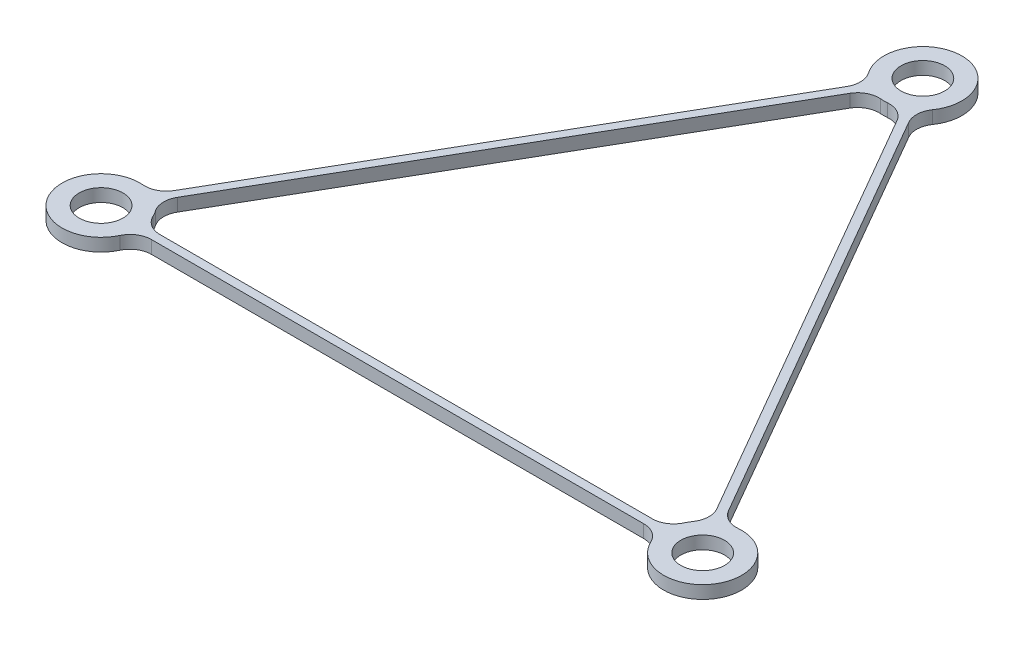
ISO-10303-21;
HEADER;
FILE_DESCRIPTION(('STEP AP214'),'2;1');
FILE_NAME('part.step','',(''),(''),'','','');
FILE_SCHEMA(('AUTOMOTIVE_DESIGN { 1 0 10303 214 1 1 1 1 }'));
ENDSEC;
DATA;
#1=APPLICATION_CONTEXT('core data for automotive mechanical design processes');
#2=APPLICATION_PROTOCOL_DEFINITION('international standard','automotive_design',2000,#1);
#3=PRODUCT_CONTEXT('',#1,'mechanical');
#4=PRODUCT('Part','Part','',(#3));
#5=PRODUCT_RELATED_PRODUCT_CATEGORY('part','',(#4));
#6=PRODUCT_DEFINITION_FORMATION('','',#4);
#7=PRODUCT_DEFINITION_CONTEXT('part definition',#1,'design');
#8=PRODUCT_DEFINITION('design','',#6,#7);
#9=PRODUCT_DEFINITION_SHAPE('','',#8);
#10=(LENGTH_UNIT() NAMED_UNIT(*) SI_UNIT(.MILLI.,.METRE.));
#11=(NAMED_UNIT(*) PLANE_ANGLE_UNIT() SI_UNIT($,.RADIAN.));
#12=(NAMED_UNIT(*) SI_UNIT($,.STERADIAN.) SOLID_ANGLE_UNIT());
#13=UNCERTAINTY_MEASURE_WITH_UNIT(LENGTH_MEASURE(1.E-05),#10,'distance_accuracy_value','');
#14=(GEOMETRIC_REPRESENTATION_CONTEXT(3) GLOBAL_UNCERTAINTY_ASSIGNED_CONTEXT((#13)) GLOBAL_UNIT_ASSIGNED_CONTEXT((#10,
#11,#12)) REPRESENTATION_CONTEXT('',''));
#15=CARTESIAN_POINT('',(0.,0.,0.));
#16=DIRECTION('',(0.,0.,1.));
#17=DIRECTION('',(1.,0.,0.));
#18=AXIS2_PLACEMENT_3D('',#15,#16,#17);
#19=CARTESIAN_POINT('',(-35.1,0.75,20.2649944485559));
#20=DIRECTION('',(0.,1.,0.));
#21=DIRECTION('',(0.,0.,1.));
#22=AXIS2_PLACEMENT_3D('',#19,#20,#21);
#23=PLANE('',#22);
#24=CARTESIAN_POINT('',(35.1,0.75,20.2649944485559));
#25=DIRECTION('',(0.,1.,0.));
#26=DIRECTION('',(0.,0.,1.));
#27=AXIS2_PLACEMENT_3D('',#24,#25,#26);
#28=CIRCLE('',#27,2.55);
#29=CARTESIAN_POINT('',(35.1,0.75,22.8149944485559));
#30=VERTEX_POINT('',#29);
#31=EDGE_CURVE('E378',#30,#30,#28,.T.);
#32=ORIENTED_EDGE('',*,*,#31,.F.);
#33=EDGE_LOOP('',(#32));
#34=FACE_BOUND('',#33,.T.);
#35=DIRECTION('',(-0.5,0.,0.866025403784439));
#36=VECTOR('',#35,1.);
#37=CARTESIAN_POINT('',(-33.27179068714,0.75,16.0984430318118));
#38=LINE('',#37,#36);
#39=CARTESIAN_POINT('',(-3.62293824961275,0.75,-35.2548757760978));
#40=VERTEX_POINT('',#39);
#41=CARTESIAN_POINT('',(-32.3430871541717,0.75,14.489881327542));
#42=VERTEX_POINT('',#41);
#43=EDGE_CURVE('E217',#40,#42,#38,.T.);
#44=ORIENTED_EDGE('',*,*,#43,.T.);
#45=CARTESIAN_POINT('',(-34.5081506636328,0.75,13.239881327542));
#46=DIRECTION('',(0.,1.,0.));
#47=DIRECTION('',(0.,0.,1.));
#48=AXIS2_PLACEMENT_3D('',#45,#46,#47);
#49=CIRCLE('',#48,2.5);
#50=CARTESIAN_POINT('',(-34.7180263148269,0.75,15.7310561931497));
#51=VERTEX_POINT('',#50);
#52=EDGE_CURVE('E276',#42,#51,#49,.F.);
#53=ORIENTED_EDGE('',*,*,#52,.T.);
#54=CARTESIAN_POINT('',(-35.1,0.75,20.2649944485559));
#55=DIRECTION('',(0.,1.,0.));
#56=DIRECTION('',(0.,0.,1.));
#57=AXIS2_PLACEMENT_3D('',#54,#55,#56);
#58=CIRCLE('',#57,4.55);
#59=CARTESIAN_POINT('',(-30.9825074490416,0.75,22.2011646613218));
#60=VERTEX_POINT('',#59);
#61=EDGE_CURVE('E225',#51,#60,#58,.T.);
#62=ORIENTED_EDGE('',*,*,#61,.T.);
#63=CARTESIAN_POINT('',(-28.720148904559,0.75,23.2649944485559));
#64=DIRECTION('',(0.,1.,0.));
#65=DIRECTION('',(0.,0.,1.));
#66=AXIS2_PLACEMENT_3D('',#63,#64,#65);
#67=CIRCLE('',#66,2.5);
#68=CARTESIAN_POINT('',(-28.720148904559,0.75,20.7649944485559));
#69=VERTEX_POINT('',#68);
#70=EDGE_CURVE('E273',#60,#69,#67,.F.);
#71=ORIENTED_EDGE('',*,*,#70,.T.);
#72=DIRECTION('',(1.,0.,0.));
#73=VECTOR('',#72,1.);
#74=CARTESIAN_POINT('',(30.5775559704956,0.75,20.7649944485559));
#75=LINE('',#74,#73);
#76=CARTESIAN_POINT('',(28.720148904559,0.75,20.7649944485559));
#77=VERTEX_POINT('',#76);
#78=EDGE_CURVE('E229',#69,#77,#75,.T.);
#79=ORIENTED_EDGE('',*,*,#78,.T.);
#80=CARTESIAN_POINT('',(28.720148904559,0.75,23.2649944485559));
#81=DIRECTION('',(0.,1.,0.));
#82=DIRECTION('',(0.,0.,1.));
#83=AXIS2_PLACEMENT_3D('',#80,#81,#82);
#84=CIRCLE('',#83,2.5);
#85=CARTESIAN_POINT('',(30.9825074490416,0.75,22.2011646613218));
#86=VERTEX_POINT('',#85);
#87=EDGE_CURVE('E269',#77,#86,#84,.F.);
#88=ORIENTED_EDGE('',*,*,#87,.T.);
#89=CARTESIAN_POINT('',(35.1,0.75,20.2649944485559));
#90=DIRECTION('',(0.,1.,0.));
#91=DIRECTION('',(0.,0.,1.));
#92=AXIS2_PLACEMENT_3D('',#89,#90,#91);
#93=CIRCLE('',#92,4.55);
#94=CARTESIAN_POINT('',(34.7180263148269,0.75,15.7310561931497));
#95=VERTEX_POINT('',#94);
#96=EDGE_CURVE('E392',#86,#95,#93,.T.);
#97=ORIENTED_EDGE('',*,*,#96,.T.);
#98=CARTESIAN_POINT('',(34.5081506636328,0.75,13.239881327542));
#99=DIRECTION('',(0.,1.,0.));
#100=DIRECTION('',(0.,0.,1.));
#101=AXIS2_PLACEMENT_3D('',#98,#99,#100);
#102=CIRCLE('',#101,2.5);
#103=CARTESIAN_POINT('',(32.3430871541717,0.75,14.489881327542));
#104=VERTEX_POINT('',#103);
#105=EDGE_CURVE('E265',#95,#104,#102,.F.);
#106=ORIENTED_EDGE('',*,*,#105,.T.);
#107=DIRECTION('',(-0.5,0.,-0.866025403784439));
#108=VECTOR('',#107,1.);
#109=CARTESIAN_POINT('',(33.27179068714,0.75,16.0984430318118));
#110=LINE('',#109,#108);
#111=CARTESIAN_POINT('',(3.62293824961274,0.75,-35.2548757760978));
#112=VERTEX_POINT('',#111);
#113=EDGE_CURVE('E395',#104,#112,#110,.T.);
#114=ORIENTED_EDGE('',*,*,#113,.T.);
#115=CARTESIAN_POINT('',(5.78800175907384,0.75,-36.5048757760978));
#116=DIRECTION('',(0.,1.,0.));
#117=DIRECTION('',(0.,0.,1.));
#118=AXIS2_PLACEMENT_3D('',#115,#116,#117);
#119=CIRCLE('',#118,2.5);
#120=CARTESIAN_POINT('',(3.73551886578525,0.75,-37.9322208544716));
#121=VERTEX_POINT('',#120);
#122=EDGE_CURVE('E261',#112,#121,#119,.F.);
#123=ORIENTED_EDGE('',*,*,#122,.T.);
#124=CARTESIAN_POINT('',(0.,0.75,-40.5299888971117));
#125=DIRECTION('',(0.,1.,0.));
#126=DIRECTION('',(0.,0.,1.));
#127=AXIS2_PLACEMENT_3D('',#124,#125,#126);
#128=CIRCLE('',#127,4.55);
#129=CARTESIAN_POINT('',(-3.73551886578525,0.75,-37.9322208544716));
#130=VERTEX_POINT('',#129);
#131=EDGE_CURVE('E398',#121,#130,#128,.T.);
#132=ORIENTED_EDGE('',*,*,#131,.T.);
#133=CARTESIAN_POINT('',(-5.78800175907385,0.75,-36.5048757760978));
#134=DIRECTION('',(0.,1.,0.));
#135=DIRECTION('',(0.,0.,1.));
#136=AXIS2_PLACEMENT_3D('',#133,#134,#135);
#137=CIRCLE('',#136,2.5);
#138=EDGE_CURVE('E207',#130,#40,#137,.F.);
#139=ORIENTED_EDGE('',*,*,#138,.T.);
#140=EDGE_LOOP('',(#44,#53,#62,#71,#79,#88,#97,#106,#114,#123,#132,#139));
#141=FACE_BOUND('',#140,.T.);
#142=CARTESIAN_POINT('',(0.,0.75,-40.5299888971117));
#143=DIRECTION('',(0.,1.,0.));
#144=DIRECTION('',(0.,0.,1.));
#145=AXIS2_PLACEMENT_3D('',#142,#143,#144);
#146=CIRCLE('',#145,2.55);
#147=CARTESIAN_POINT('',(0.,0.75,-37.9799888971117));
#148=VERTEX_POINT('',#147);
#149=EDGE_CURVE('E384',#148,#148,#146,.T.);
#150=ORIENTED_EDGE('',*,*,#149,.F.);
#151=EDGE_LOOP('',(#150));
#152=FACE_BOUND('',#151,.T.);
#153=CARTESIAN_POINT('',(-35.1,0.75,20.2649944485559));
#154=DIRECTION('',(0.,1.,0.));
#155=DIRECTION('',(0.,0.,1.));
#156=AXIS2_PLACEMENT_3D('',#153,#154,#155);
#157=CIRCLE('',#156,2.55);
#158=CARTESIAN_POINT('',(-35.1,0.75,22.8149944485559));
#159=VERTEX_POINT('',#158);
#160=EDGE_CURVE('E372',#159,#159,#157,.T.);
#161=ORIENTED_EDGE('',*,*,#160,.F.);
#162=EDGE_LOOP('',(#161));
#163=FACE_BOUND('',#162,.T.);
#164=DIRECTION('',(-0.5,0.,0.866025403784439));
#165=VECTOR('',#164,1.);
#166=CARTESIAN_POINT('',(-1.82820931286,0.75,-36.3634374803677));
#167=LINE('',#166,#165);
#168=CARTESIAN_POINT('',(-2.75691284582831,0.75,-34.7548757760978));
#169=VERTEX_POINT('',#168);
#170=CARTESIAN_POINT('',(-31.4770617503873,0.75,14.989881327542));
#171=VERTEX_POINT('',#170);
#172=EDGE_CURVE('E344',#169,#171,#167,.T.);
#173=ORIENTED_EDGE('',*,*,#172,.F.);
#174=CARTESIAN_POINT('',(-0.591849336367215,0.75,-33.5048757760978));
#175=DIRECTION('',(0.,1.,0.));
#176=DIRECTION('',(0.,0.,1.));
#177=AXIS2_PLACEMENT_3D('',#174,#175,#176);
#178=CIRCLE('',#177,2.5);
#179=CARTESIAN_POINT('',(-0.381973685173168,0.75,-35.9960506417056));
#180=VERTEX_POINT('',#179);
#181=EDGE_CURVE('E11',#169,#180,#178,.F.);
#182=ORIENTED_EDGE('',*,*,#181,.T.);
#183=CARTESIAN_POINT('',(0.,0.75,-40.5299888971117));
#184=DIRECTION('',(0.,-1.,0.));
#185=DIRECTION('',(0.,0.,1.));
#186=AXIS2_PLACEMENT_3D('',#183,#184,#185);
#187=CIRCLE('',#186,4.55);
#188=CARTESIAN_POINT('',(0.381973685173135,0.75,-35.9960506417056));
#189=VERTEX_POINT('',#188);
#190=EDGE_CURVE('E342',#189,#180,#187,.T.);
#191=ORIENTED_EDGE('',*,*,#190,.F.);
#192=CARTESIAN_POINT('',(0.591849336367165,0.75,-33.5048757760978));
#193=DIRECTION('',(0.,1.,0.));
#194=DIRECTION('',(0.,0.,1.));
#195=AXIS2_PLACEMENT_3D('',#192,#193,#194);
#196=CIRCLE('',#195,2.5);
#197=CARTESIAN_POINT('',(2.75691284582827,0.75,-34.7548757760978));
#198=VERTEX_POINT('',#197);
#199=EDGE_CURVE('E325',#189,#198,#196,.F.);
#200=ORIENTED_EDGE('',*,*,#199,.T.);
#201=DIRECTION('',(-0.5,0.,-0.866025403784438));
#202=VECTOR('',#201,1.);
#203=CARTESIAN_POINT('',(32.4057652833556,0.75,16.5984430318118));
#204=LINE('',#203,#202);
#205=CARTESIAN_POINT('',(31.4770617503873,0.75,14.989881327542));
#206=VERTEX_POINT('',#205);
#207=EDGE_CURVE('E360',#206,#198,#204,.T.);
#208=ORIENTED_EDGE('',*,*,#207,.F.);
#209=CARTESIAN_POINT('',(29.3119982409262,0.75,16.239881327542));
#210=DIRECTION('',(0.,1.,0.));
#211=DIRECTION('',(0.,0.,1.));
#212=AXIS2_PLACEMENT_3D('',#209,#210,#211);
#213=CIRCLE('',#212,2.5);
#214=CARTESIAN_POINT('',(31.3644811342148,0.75,17.6672264059157));
#215=VERTEX_POINT('',#214);
#216=EDGE_CURVE('E321',#206,#215,#213,.F.);
#217=ORIENTED_EDGE('',*,*,#216,.T.);
#218=CARTESIAN_POINT('',(35.1,0.75,20.2649944485559));
#219=DIRECTION('',(0.,-1.,0.));
#220=DIRECTION('',(0.,0.,1.));
#221=AXIS2_PLACEMENT_3D('',#218,#219,#220);
#222=CIRCLE('',#221,4.55);
#223=CARTESIAN_POINT('',(30.9825074490416,0.75,18.3288242357899));
#224=VERTEX_POINT('',#223);
#225=EDGE_CURVE('E357',#224,#215,#222,.T.);
#226=ORIENTED_EDGE('',*,*,#225,.F.);
#227=CARTESIAN_POINT('',(28.720148904559,0.75,17.2649944485559));
#228=DIRECTION('',(0.,1.,0.));
#229=DIRECTION('',(0.,0.,1.));
#230=AXIS2_PLACEMENT_3D('',#227,#228,#229);
#231=CIRCLE('',#230,2.5);
#232=CARTESIAN_POINT('',(28.720148904559,0.75,19.7649944485559));
#233=VERTEX_POINT('',#232);
#234=EDGE_CURVE('E317',#224,#233,#231,.F.);
#235=ORIENTED_EDGE('',*,*,#234,.T.);
#236=DIRECTION('',(1.,0.,0.));
#237=VECTOR('',#236,1.);
#238=CARTESIAN_POINT('',(-30.5775559704956,0.75,19.7649944485559));
#239=LINE('',#238,#237);
#240=CARTESIAN_POINT('',(-28.720148904559,0.75,19.7649944485559));
#241=VERTEX_POINT('',#240);
#242=EDGE_CURVE('E354',#241,#233,#239,.T.);
#243=ORIENTED_EDGE('',*,*,#242,.F.);
#244=CARTESIAN_POINT('',(-28.720148904559,0.75,17.2649944485559));
#245=DIRECTION('',(0.,1.,0.));
#246=DIRECTION('',(0.,0.,1.));
#247=AXIS2_PLACEMENT_3D('',#244,#245,#246);
#248=CIRCLE('',#247,2.5);
#249=CARTESIAN_POINT('',(-30.9825074490416,0.75,18.3288242357899));
#250=VERTEX_POINT('',#249);
#251=EDGE_CURVE('E313',#241,#250,#248,.F.);
#252=ORIENTED_EDGE('',*,*,#251,.T.);
#253=CARTESIAN_POINT('',(-35.1,0.75,20.2649944485559));
#254=DIRECTION('',(0.,-1.,0.));
#255=DIRECTION('',(0.,0.,1.));
#256=AXIS2_PLACEMENT_3D('',#253,#254,#255);
#257=CIRCLE('',#256,4.55);
#258=CARTESIAN_POINT('',(-31.3644811342148,0.75,17.6672264059157));
#259=VERTEX_POINT('',#258);
#260=EDGE_CURVE('E347',#259,#250,#257,.T.);
#261=ORIENTED_EDGE('',*,*,#260,.F.);
#262=CARTESIAN_POINT('',(-29.3119982409262,0.75,16.239881327542));
#263=DIRECTION('',(0.,1.,0.));
#264=DIRECTION('',(0.,0.,1.));
#265=AXIS2_PLACEMENT_3D('',#262,#263,#264);
#266=CIRCLE('',#265,2.5);
#267=EDGE_CURVE('E309',#259,#171,#266,.F.);
#268=ORIENTED_EDGE('',*,*,#267,.T.);
#269=EDGE_LOOP('',(#173,#182,#191,#200,#208,#217,#226,#235,#243,#252,#261,#268));
#270=FACE_BOUND('',#269,.T.);
#271=ADVANCED_FACE('F36',(#34,#141,#152,#163,#270),#23,.T.);
#272=CARTESIAN_POINT('',(-35.1,-0.75,20.2649944485559));
#273=DIRECTION('',(0.,1.,0.));
#274=DIRECTION('',(0.,0.,1.));
#275=AXIS2_PLACEMENT_3D('',#272,#273,#274);
#276=PLANE('',#275);
#277=CARTESIAN_POINT('',(-35.1,-0.75,20.2649944485559));
#278=DIRECTION('',(0.,1.,0.));
#279=DIRECTION('',(0.,0.,1.));
#280=AXIS2_PLACEMENT_3D('',#277,#278,#279);
#281=CIRCLE('',#280,2.55);
#282=CARTESIAN_POINT('',(-35.1,-0.75,22.8149944485559));
#283=VERTEX_POINT('',#282);
#284=EDGE_CURVE('E363',#283,#283,#281,.T.);
#285=ORIENTED_EDGE('',*,*,#284,.T.);
#286=EDGE_LOOP('',(#285));
#287=FACE_BOUND('',#286,.T.);
#288=CARTESIAN_POINT('',(35.1,-0.75,20.2649944485559));
#289=DIRECTION('',(0.,1.,0.));
#290=DIRECTION('',(0.,0.,1.));
#291=AXIS2_PLACEMENT_3D('',#288,#289,#290);
#292=CIRCLE('',#291,2.55);
#293=CARTESIAN_POINT('',(35.1,-0.75,22.8149944485559));
#294=VERTEX_POINT('',#293);
#295=EDGE_CURVE('E375',#294,#294,#292,.T.);
#296=ORIENTED_EDGE('',*,*,#295,.T.);
#297=EDGE_LOOP('',(#296));
#298=FACE_BOUND('',#297,.T.);
#299=CARTESIAN_POINT('',(0.,-0.75,-40.5299888971117));
#300=DIRECTION('',(0.,1.,0.));
#301=DIRECTION('',(0.,0.,1.));
#302=AXIS2_PLACEMENT_3D('',#299,#300,#301);
#303=CIRCLE('',#302,2.55);
#304=CARTESIAN_POINT('',(0.,-0.75,-37.9799888971117));
#305=VERTEX_POINT('',#304);
#306=EDGE_CURVE('E381',#305,#305,#303,.T.);
#307=ORIENTED_EDGE('',*,*,#306,.T.);
#308=EDGE_LOOP('',(#307));
#309=FACE_BOUND('',#308,.T.);
#310=CARTESIAN_POINT('',(-35.1,-0.75,20.2649944485559));
#311=DIRECTION('',(0.,1.,0.));
#312=DIRECTION('',(0.,0.,1.));
#313=AXIS2_PLACEMENT_3D('',#310,#311,#312);
#314=CIRCLE('',#313,4.55);
#315=CARTESIAN_POINT('',(-34.7180263148269,-0.75,15.7310561931497));
#316=VERTEX_POINT('',#315);
#317=CARTESIAN_POINT('',(-30.9825074490416,-0.75,22.2011646613218));
#318=VERTEX_POINT('',#317);
#319=EDGE_CURVE('E387',#316,#318,#314,.T.);
#320=ORIENTED_EDGE('',*,*,#319,.F.);
#321=CARTESIAN_POINT('',(-34.5081506636328,-0.75,13.239881327542));
#322=DIRECTION('',(0.,1.,0.));
#323=DIRECTION('',(0.,0.,1.));
#324=AXIS2_PLACEMENT_3D('',#321,#322,#323);
#325=CIRCLE('',#324,2.5);
#326=CARTESIAN_POINT('',(-32.3430871541717,-0.75,14.489881327542));
#327=VERTEX_POINT('',#326);
#328=EDGE_CURVE('E224',#316,#327,#325,.T.);
#329=ORIENTED_EDGE('',*,*,#328,.T.);
#330=DIRECTION('',(-0.5,0.,0.866025403784439));
#331=VECTOR('',#330,1.);
#332=CARTESIAN_POINT('',(-33.27179068714,-0.75,16.0984430318118));
#333=LINE('',#332,#331);
#334=CARTESIAN_POINT('',(-3.62293824961275,-0.75,-35.2548757760978));
#335=VERTEX_POINT('',#334);
#336=EDGE_CURVE('E214',#335,#327,#333,.T.);
#337=ORIENTED_EDGE('',*,*,#336,.F.);
#338=CARTESIAN_POINT('',(-5.78800175907385,-0.75,-36.5048757760978));
#339=DIRECTION('',(0.,1.,0.));
#340=DIRECTION('',(0.,0.,1.));
#341=AXIS2_PLACEMENT_3D('',#338,#339,#340);
#342=CIRCLE('',#341,2.5);
#343=CARTESIAN_POINT('',(-3.73551886578525,-0.75,-37.9322208544716));
#344=VERTEX_POINT('',#343);
#345=EDGE_CURVE('E197',#335,#344,#342,.T.);
#346=ORIENTED_EDGE('',*,*,#345,.T.);
#347=CARTESIAN_POINT('',(0.,-0.75,-40.5299888971117));
#348=DIRECTION('',(0.,1.,0.));
#349=DIRECTION('',(0.,0.,1.));
#350=AXIS2_PLACEMENT_3D('',#347,#348,#349);
#351=CIRCLE('',#350,4.55);
#352=CARTESIAN_POINT('',(3.73551886578525,-0.75,-37.9322208544716));
#353=VERTEX_POINT('',#352);
#354=EDGE_CURVE('E226',#353,#344,#351,.T.);
#355=ORIENTED_EDGE('',*,*,#354,.F.);
#356=CARTESIAN_POINT('',(5.78800175907384,-0.75,-36.5048757760978));
#357=DIRECTION('',(0.,1.,0.));
#358=DIRECTION('',(0.,0.,1.));
#359=AXIS2_PLACEMENT_3D('',#356,#357,#358);
#360=CIRCLE('',#359,2.5);
#361=CARTESIAN_POINT('',(3.62293824961274,-0.75,-35.2548757760978));
#362=VERTEX_POINT('',#361);
#363=EDGE_CURVE('E259',#353,#362,#360,.T.);
#364=ORIENTED_EDGE('',*,*,#363,.T.);
#365=DIRECTION('',(-0.5,0.,-0.866025403784439));
#366=VECTOR('',#365,1.);
#367=CARTESIAN_POINT('',(33.27179068714,-0.75,16.0984430318118));
#368=LINE('',#367,#366);
#369=CARTESIAN_POINT('',(32.3430871541717,-0.75,14.489881327542));
#370=VERTEX_POINT('',#369);
#371=EDGE_CURVE('E231',#370,#362,#368,.T.);
#372=ORIENTED_EDGE('',*,*,#371,.F.);
#373=CARTESIAN_POINT('',(34.5081506636328,-0.75,13.239881327542));
#374=DIRECTION('',(0.,1.,0.));
#375=DIRECTION('',(0.,0.,1.));
#376=AXIS2_PLACEMENT_3D('',#373,#374,#375);
#377=CIRCLE('',#376,2.5);
#378=CARTESIAN_POINT('',(34.7180263148269,-0.75,15.7310561931497));
#379=VERTEX_POINT('',#378);
#380=EDGE_CURVE('E263',#370,#379,#377,.T.);
#381=ORIENTED_EDGE('',*,*,#380,.T.);
#382=CARTESIAN_POINT('',(35.1,-0.75,20.2649944485559));
#383=DIRECTION('',(0.,1.,0.));
#384=DIRECTION('',(0.,0.,1.));
#385=AXIS2_PLACEMENT_3D('',#382,#383,#384);
#386=CIRCLE('',#385,4.55);
#387=CARTESIAN_POINT('',(30.9825074490416,-0.75,22.2011646613218));
#388=VERTEX_POINT('',#387);
#389=EDGE_CURVE('E407',#388,#379,#386,.T.);
#390=ORIENTED_EDGE('',*,*,#389,.F.);
#391=CARTESIAN_POINT('',(28.720148904559,-0.75,23.2649944485559));
#392=DIRECTION('',(0.,1.,0.));
#393=DIRECTION('',(0.,0.,1.));
#394=AXIS2_PLACEMENT_3D('',#391,#392,#393);
#395=CIRCLE('',#394,2.5);
#396=CARTESIAN_POINT('',(28.720148904559,-0.75,20.7649944485559));
#397=VERTEX_POINT('',#396);
#398=EDGE_CURVE('E267',#388,#397,#395,.T.);
#399=ORIENTED_EDGE('',*,*,#398,.T.);
#400=DIRECTION('',(1.,0.,0.));
#401=VECTOR('',#400,1.);
#402=CARTESIAN_POINT('',(30.5775559704956,-0.75,20.7649944485559));
#403=LINE('',#402,#401);
#404=CARTESIAN_POINT('',(-28.720148904559,-0.75,20.7649944485559));
#405=VERTEX_POINT('',#404);
#406=EDGE_CURVE('E404',#405,#397,#403,.T.);
#407=ORIENTED_EDGE('',*,*,#406,.F.);
#408=CARTESIAN_POINT('',(-28.720148904559,-0.75,23.2649944485559));
#409=DIRECTION('',(0.,1.,0.));
#410=DIRECTION('',(0.,0.,1.));
#411=AXIS2_PLACEMENT_3D('',#408,#409,#410);
#412=CIRCLE('',#411,2.5);
#413=EDGE_CURVE('E271',#405,#318,#412,.T.);
#414=ORIENTED_EDGE('',*,*,#413,.T.);
#415=EDGE_LOOP('',(#320,#329,#337,#346,#355,#364,#372,#381,#390,#399,#407,#414));
#416=FACE_BOUND('',#415,.T.);
#417=DIRECTION('',(-0.5,0.,-0.866025403784438));
#418=VECTOR('',#417,1.);
#419=CARTESIAN_POINT('',(32.4057652833556,-0.75,16.5984430318118));
#420=LINE('',#419,#418);
#421=CARTESIAN_POINT('',(31.4770617503873,-0.75,14.989881327542));
#422=VERTEX_POINT('',#421);
#423=CARTESIAN_POINT('',(2.75691284582827,-0.75,-34.7548757760978));
#424=VERTEX_POINT('',#423);
#425=EDGE_CURVE('E345',#422,#424,#420,.T.);
#426=ORIENTED_EDGE('',*,*,#425,.T.);
#427=CARTESIAN_POINT('',(0.591849336367165,-0.75,-33.5048757760978));
#428=DIRECTION('',(0.,1.,0.));
#429=DIRECTION('',(0.,0.,1.));
#430=AXIS2_PLACEMENT_3D('',#427,#428,#429);
#431=CIRCLE('',#430,2.5);
#432=CARTESIAN_POINT('',(0.381973685173135,-0.75,-35.9960506417056));
#433=VERTEX_POINT('',#432);
#434=EDGE_CURVE('E323',#424,#433,#431,.T.);
#435=ORIENTED_EDGE('',*,*,#434,.T.);
#436=CARTESIAN_POINT('',(0.,-0.75,-40.5299888971117));
#437=DIRECTION('',(0.,-1.,0.));
#438=DIRECTION('',(0.,0.,1.));
#439=AXIS2_PLACEMENT_3D('',#436,#437,#438);
#440=CIRCLE('',#439,4.55);
#441=CARTESIAN_POINT('',(-0.381973685173168,-0.75,-35.9960506417056));
#442=VERTEX_POINT('',#441);
#443=EDGE_CURVE('E331',#433,#442,#440,.T.);
#444=ORIENTED_EDGE('',*,*,#443,.T.);
#445=CARTESIAN_POINT('',(-0.591849336367215,-0.75,-33.5048757760978));
#446=DIRECTION('',(0.,1.,0.));
#447=DIRECTION('',(0.,0.,1.));
#448=AXIS2_PLACEMENT_3D('',#445,#446,#447);
#449=CIRCLE('',#448,2.5);
#450=CARTESIAN_POINT('',(-2.75691284582831,-0.75,-34.7548757760978));
#451=VERTEX_POINT('',#450);
#452=EDGE_CURVE('E44',#442,#451,#449,.T.);
#453=ORIENTED_EDGE('',*,*,#452,.T.);
#454=DIRECTION('',(-0.5,0.,0.866025403784439));
#455=VECTOR('',#454,1.);
#456=CARTESIAN_POINT('',(-1.82820931286,-0.75,-36.3634374803677));
#457=LINE('',#456,#455);
#458=CARTESIAN_POINT('',(-31.4770617503873,-0.75,14.989881327542));
#459=VERTEX_POINT('',#458);
#460=EDGE_CURVE('E330',#451,#459,#457,.T.);
#461=ORIENTED_EDGE('',*,*,#460,.T.);
#462=CARTESIAN_POINT('',(-29.3119982409262,-0.75,16.239881327542));
#463=DIRECTION('',(0.,1.,0.));
#464=DIRECTION('',(0.,0.,1.));
#465=AXIS2_PLACEMENT_3D('',#462,#463,#464);
#466=CIRCLE('',#465,2.5);
#467=CARTESIAN_POINT('',(-31.3644811342148,-0.75,17.6672264059157));
#468=VERTEX_POINT('',#467);
#469=EDGE_CURVE('E307',#459,#468,#466,.T.);
#470=ORIENTED_EDGE('',*,*,#469,.T.);
#471=CARTESIAN_POINT('',(-35.1,-0.75,20.2649944485559));
#472=DIRECTION('',(0.,-1.,0.));
#473=DIRECTION('',(0.,0.,1.));
#474=AXIS2_PLACEMENT_3D('',#471,#472,#473);
#475=CIRCLE('',#474,4.55);
#476=CARTESIAN_POINT('',(-30.9825074490416,-0.75,18.3288242357899));
#477=VERTEX_POINT('',#476);
#478=EDGE_CURVE('E339',#468,#477,#475,.T.);
#479=ORIENTED_EDGE('',*,*,#478,.T.);
#480=CARTESIAN_POINT('',(-28.720148904559,-0.75,17.2649944485559));
#481=DIRECTION('',(0.,1.,0.));
#482=DIRECTION('',(0.,0.,1.));
#483=AXIS2_PLACEMENT_3D('',#480,#481,#482);
#484=CIRCLE('',#483,2.5);
#485=CARTESIAN_POINT('',(-28.720148904559,-0.75,19.7649944485559));
#486=VERTEX_POINT('',#485);
#487=EDGE_CURVE('E311',#477,#486,#484,.T.);
#488=ORIENTED_EDGE('',*,*,#487,.T.);
#489=DIRECTION('',(1.,0.,0.));
#490=VECTOR('',#489,1.);
#491=CARTESIAN_POINT('',(-30.5775559704956,-0.75,19.7649944485559));
#492=LINE('',#491,#490);
#493=CARTESIAN_POINT('',(28.720148904559,-0.75,19.7649944485559));
#494=VERTEX_POINT('',#493);
#495=EDGE_CURVE('E367',#486,#494,#492,.T.);
#496=ORIENTED_EDGE('',*,*,#495,.T.);
#497=CARTESIAN_POINT('',(28.720148904559,-0.75,17.2649944485559));
#498=DIRECTION('',(0.,1.,0.));
#499=DIRECTION('',(0.,0.,1.));
#500=AXIS2_PLACEMENT_3D('',#497,#498,#499);
#501=CIRCLE('',#500,2.5);
#502=CARTESIAN_POINT('',(30.9825074490416,-0.75,18.3288242357899));
#503=VERTEX_POINT('',#502);
#504=EDGE_CURVE('E315',#494,#503,#501,.T.);
#505=ORIENTED_EDGE('',*,*,#504,.T.);
#506=CARTESIAN_POINT('',(35.1,-0.75,20.2649944485559));
#507=DIRECTION('',(0.,-1.,0.));
#508=DIRECTION('',(0.,0.,1.));
#509=AXIS2_PLACEMENT_3D('',#506,#507,#508);
#510=CIRCLE('',#509,4.55);
#511=CARTESIAN_POINT('',(31.3644811342148,-0.75,17.6672264059157));
#512=VERTEX_POINT('',#511);
#513=EDGE_CURVE('E349',#503,#512,#510,.T.);
#514=ORIENTED_EDGE('',*,*,#513,.T.);
#515=CARTESIAN_POINT('',(29.3119982409262,-0.75,16.239881327542));
#516=DIRECTION('',(0.,1.,0.));
#517=DIRECTION('',(0.,0.,1.));
#518=AXIS2_PLACEMENT_3D('',#515,#516,#517);
#519=CIRCLE('',#518,2.5);
#520=EDGE_CURVE('E319',#512,#422,#519,.T.);
#521=ORIENTED_EDGE('',*,*,#520,.T.);
#522=EDGE_LOOP('',(#426,#435,#444,#453,#461,#470,#479,#488,#496,#505,#514,#521));
#523=FACE_BOUND('',#522,.T.);
#524=ADVANCED_FACE('F222',(#287,#298,#309,#416,#523),#276,.F.);
#525=CARTESIAN_POINT('',(-35.1,0.75,20.2649944485559));
#526=DIRECTION('',(0.,-1.,0.));
#527=DIRECTION('',(0.,0.,-1.));
#528=AXIS2_PLACEMENT_3D('',#525,#526,#527);
#529=CYLINDRICAL_SURFACE('',#528,4.55);
#530=ORIENTED_EDGE('',*,*,#319,.T.);
#531=DIRECTION('',(0.,-1.,0.));
#532=VECTOR('',#531,1.);
#533=CARTESIAN_POINT('',(-30.9825074490416,0.75,22.2011646613218));
#534=LINE('',#533,#532);
#535=EDGE_CURVE('E208',#318,#60,#534,.F.);
#536=ORIENTED_EDGE('',*,*,#535,.T.);
#537=ORIENTED_EDGE('',*,*,#61,.F.);
#538=DIRECTION('',(0.,-1.,0.));
#539=VECTOR('',#538,1.);
#540=CARTESIAN_POINT('',(-34.7180263148269,0.75,15.7310561931497));
#541=LINE('',#540,#539);
#542=EDGE_CURVE('E254',#51,#316,#541,.T.);
#543=ORIENTED_EDGE('',*,*,#542,.T.);
#544=EDGE_LOOP('',(#530,#536,#537,#543));
#545=FACE_BOUND('',#544,.T.);
#546=ADVANCED_FACE('F441',(#545),#529,.T.);
#547=CARTESIAN_POINT('',(30.5775559704956,0.75,20.7649944485559));
#548=DIRECTION('',(0.,0.,-1.));
#549=DIRECTION('',(-1.,0.,0.));
#550=AXIS2_PLACEMENT_3D('',#547,#548,#549);
#551=PLANE('',#550);
#552=ORIENTED_EDGE('',*,*,#406,.T.);
#553=DIRECTION('',(0.,1.,0.));
#554=VECTOR('',#553,1.);
#555=CARTESIAN_POINT('',(28.720148904559,0.75,20.7649944485559));
#556=LINE('',#555,#554);
#557=EDGE_CURVE('E252',#397,#77,#556,.T.);
#558=ORIENTED_EDGE('',*,*,#557,.T.);
#559=ORIENTED_EDGE('',*,*,#78,.F.);
#560=DIRECTION('',(0.,1.,0.));
#561=VECTOR('',#560,1.);
#562=CARTESIAN_POINT('',(-28.720148904559,-0.75,20.7649944485559));
#563=LINE('',#562,#561);
#564=EDGE_CURVE('E249',#69,#405,#563,.F.);
#565=ORIENTED_EDGE('',*,*,#564,.T.);
#566=EDGE_LOOP('',(#552,#558,#559,#565));
#567=FACE_BOUND('',#566,.T.);
#568=ADVANCED_FACE('F702',(#567),#551,.F.);
#569=CARTESIAN_POINT('',(35.1,0.75,20.2649944485559));
#570=DIRECTION('',(0.,-1.,0.));
#571=DIRECTION('',(0.,0.,-1.));
#572=AXIS2_PLACEMENT_3D('',#569,#570,#571);
#573=CYLINDRICAL_SURFACE('',#572,4.55);
#574=ORIENTED_EDGE('',*,*,#389,.T.);
#575=DIRECTION('',(0.,-1.,0.));
#576=VECTOR('',#575,1.);
#577=CARTESIAN_POINT('',(34.7180263148269,0.75,15.7310561931497));
#578=LINE('',#577,#576);
#579=EDGE_CURVE('E247',#379,#95,#578,.F.);
#580=ORIENTED_EDGE('',*,*,#579,.T.);
#581=ORIENTED_EDGE('',*,*,#96,.F.);
#582=DIRECTION('',(0.,-1.,0.));
#583=VECTOR('',#582,1.);
#584=CARTESIAN_POINT('',(30.9825074490416,0.75,22.2011646613218));
#585=LINE('',#584,#583);
#586=EDGE_CURVE('E244',#86,#388,#585,.T.);
#587=ORIENTED_EDGE('',*,*,#586,.T.);
#588=EDGE_LOOP('',(#574,#580,#581,#587));
#589=FACE_BOUND('',#588,.T.);
#590=ADVANCED_FACE('F433',(#589),#573,.T.);
#591=CARTESIAN_POINT('',(33.27179068714,0.75,16.0984430318118));
#592=DIRECTION('',(-0.866025403784439,0.,0.5));
#593=DIRECTION('',(0.5,0.,0.866025403784439));
#594=AXIS2_PLACEMENT_3D('',#591,#592,#593);
#595=PLANE('',#594);
#596=ORIENTED_EDGE('',*,*,#371,.T.);
#597=DIRECTION('',(0.,1.,0.));
#598=VECTOR('',#597,1.);
#599=CARTESIAN_POINT('',(3.62293824961274,0.75,-35.2548757760978));
#600=LINE('',#599,#598);
#601=EDGE_CURVE('E242',#362,#112,#600,.T.);
#602=ORIENTED_EDGE('',*,*,#601,.T.);
#603=ORIENTED_EDGE('',*,*,#113,.F.);
#604=DIRECTION('',(0.,1.,0.));
#605=VECTOR('',#604,1.);
#606=CARTESIAN_POINT('',(32.3430871541717,-0.75,14.489881327542));
#607=LINE('',#606,#605);
#608=EDGE_CURVE('E239',#104,#370,#607,.F.);
#609=ORIENTED_EDGE('',*,*,#608,.T.);
#610=EDGE_LOOP('',(#596,#602,#603,#609));
#611=FACE_BOUND('',#610,.T.);
#612=ADVANCED_FACE('F413',(#611),#595,.F.);
#613=CARTESIAN_POINT('',(0.,0.75,-40.5299888971117));
#614=DIRECTION('',(0.,-1.,0.));
#615=DIRECTION('',(0.,0.,-1.));
#616=AXIS2_PLACEMENT_3D('',#613,#614,#615);
#617=CYLINDRICAL_SURFACE('',#616,4.55);
#618=ORIENTED_EDGE('',*,*,#354,.T.);
#619=DIRECTION('',(0.,-1.,0.));
#620=VECTOR('',#619,1.);
#621=CARTESIAN_POINT('',(-3.73551886578525,0.75,-37.9322208544716));
#622=LINE('',#621,#620);
#623=EDGE_CURVE('E202',#344,#130,#622,.F.);
#624=ORIENTED_EDGE('',*,*,#623,.T.);
#625=ORIENTED_EDGE('',*,*,#131,.F.);
#626=DIRECTION('',(0.,-1.,0.));
#627=VECTOR('',#626,1.);
#628=CARTESIAN_POINT('',(3.73551886578525,0.75,-37.9322208544716));
#629=LINE('',#628,#627);
#630=EDGE_CURVE('E218',#121,#353,#629,.T.);
#631=ORIENTED_EDGE('',*,*,#630,.T.);
#632=EDGE_LOOP('',(#618,#624,#625,#631));
#633=FACE_BOUND('',#632,.T.);
#634=ADVANCED_FACE('F424',(#633),#617,.T.);
#635=CARTESIAN_POINT('',(-33.27179068714,0.75,16.0984430318118));
#636=DIRECTION('',(0.866025403784439,0.,0.5));
#637=DIRECTION('',(0.5,0.,-0.866025403784439));
#638=AXIS2_PLACEMENT_3D('',#635,#636,#637);
#639=PLANE('',#638);
#640=ORIENTED_EDGE('',*,*,#43,.F.);
#641=DIRECTION('',(0.,1.,0.));
#642=VECTOR('',#641,1.);
#643=CARTESIAN_POINT('',(-3.62293824961274,-0.75,-35.2548757760978));
#644=LINE('',#643,#642);
#645=EDGE_CURVE('E201',#40,#335,#644,.F.);
#646=ORIENTED_EDGE('',*,*,#645,.T.);
#647=ORIENTED_EDGE('',*,*,#336,.T.);
#648=DIRECTION('',(0.,1.,0.));
#649=VECTOR('',#648,1.);
#650=CARTESIAN_POINT('',(-32.3430871541717,0.75,14.489881327542));
#651=LINE('',#650,#649);
#652=EDGE_CURVE('E219',#327,#42,#651,.T.);
#653=ORIENTED_EDGE('',*,*,#652,.T.);
#654=EDGE_LOOP('',(#640,#646,#647,#653));
#655=FACE_BOUND('',#654,.T.);
#656=ADVANCED_FACE('F213',(#655),#639,.F.);
#657=CARTESIAN_POINT('',(0.,0.75,-40.5299888971117));
#658=DIRECTION('',(0.,-1.,0.));
#659=DIRECTION('',(0.,0.,-1.));
#660=AXIS2_PLACEMENT_3D('',#657,#658,#659);
#661=CYLINDRICAL_SURFACE('',#660,2.55);
#662=ORIENTED_EDGE('',*,*,#149,.T.);
#663=EDGE_LOOP('',(#662));
#664=FACE_BOUND('',#663,.T.);
#665=ORIENTED_EDGE('',*,*,#306,.F.);
#666=EDGE_LOOP('',(#665));
#667=FACE_BOUND('',#666,.T.);
#668=ADVANCED_FACE('F431',(#664,#667),#661,.F.);
#669=CARTESIAN_POINT('',(35.1,0.75,20.2649944485559));
#670=DIRECTION('',(0.,-1.,0.));
#671=DIRECTION('',(0.,0.,-1.));
#672=AXIS2_PLACEMENT_3D('',#669,#670,#671);
#673=CYLINDRICAL_SURFACE('',#672,2.55);
#674=ORIENTED_EDGE('',*,*,#31,.T.);
#675=EDGE_LOOP('',(#674));
#676=FACE_BOUND('',#675,.T.);
#677=ORIENTED_EDGE('',*,*,#295,.F.);
#678=EDGE_LOOP('',(#677));
#679=FACE_BOUND('',#678,.T.);
#680=ADVANCED_FACE('F448',(#676,#679),#673,.F.);
#681=CARTESIAN_POINT('',(-35.1,0.75,20.2649944485559));
#682=DIRECTION('',(0.,-1.,0.));
#683=DIRECTION('',(0.,0.,-1.));
#684=AXIS2_PLACEMENT_3D('',#681,#682,#683);
#685=CYLINDRICAL_SURFACE('',#684,2.55);
#686=ORIENTED_EDGE('',*,*,#160,.T.);
#687=EDGE_LOOP('',(#686));
#688=FACE_BOUND('',#687,.T.);
#689=ORIENTED_EDGE('',*,*,#284,.F.);
#690=EDGE_LOOP('',(#689));
#691=FACE_BOUND('',#690,.T.);
#692=ADVANCED_FACE('F452',(#688,#691),#685,.F.);
#693=CARTESIAN_POINT('',(0.,0.75,-40.5299888971117));
#694=DIRECTION('',(0.,-1.,0.));
#695=DIRECTION('',(0.,0.,-1.));
#696=AXIS2_PLACEMENT_3D('',#693,#694,#695);
#697=CYLINDRICAL_SURFACE('',#696,4.55);
#698=ORIENTED_EDGE('',*,*,#443,.F.);
#699=DIRECTION('',(0.,-1.,0.));
#700=VECTOR('',#699,1.);
#701=CARTESIAN_POINT('',(0.381973685173135,0.75,-35.9960506417056));
#702=LINE('',#701,#700);
#703=EDGE_CURVE('E56',#433,#189,#702,.F.);
#704=ORIENTED_EDGE('',*,*,#703,.T.);
#705=ORIENTED_EDGE('',*,*,#190,.T.);
#706=DIRECTION('',(0.,-1.,0.));
#707=VECTOR('',#706,1.);
#708=CARTESIAN_POINT('',(-0.381973685173167,0.75,-35.9960506417056));
#709=LINE('',#708,#707);
#710=EDGE_CURVE('E303',#180,#442,#709,.T.);
#711=ORIENTED_EDGE('',*,*,#710,.T.);
#712=EDGE_LOOP('',(#698,#704,#705,#711));
#713=FACE_BOUND('',#712,.T.);
#714=ADVANCED_FACE('F341',(#713),#697,.T.);
#715=CARTESIAN_POINT('',(-1.82820931286,0.75,-36.3634374803677));
#716=DIRECTION('',(0.866025403784439,0.,0.5));
#717=DIRECTION('',(0.5,0.,-0.866025403784439));
#718=AXIS2_PLACEMENT_3D('',#715,#716,#717);
#719=PLANE('',#718);
#720=ORIENTED_EDGE('',*,*,#172,.T.);
#721=DIRECTION('',(0.,1.,0.));
#722=VECTOR('',#721,1.);
#723=CARTESIAN_POINT('',(-31.4770617503873,-0.75,14.989881327542));
#724=LINE('',#723,#722);
#725=EDGE_CURVE('E280',#171,#459,#724,.F.);
#726=ORIENTED_EDGE('',*,*,#725,.T.);
#727=ORIENTED_EDGE('',*,*,#460,.F.);
#728=DIRECTION('',(0.,1.,0.));
#729=VECTOR('',#728,1.);
#730=CARTESIAN_POINT('',(-2.75691284582831,0.75,-34.7548757760978));
#731=LINE('',#730,#729);
#732=EDGE_CURVE('E278',#451,#169,#731,.T.);
#733=ORIENTED_EDGE('',*,*,#732,.T.);
#734=EDGE_LOOP('',(#720,#726,#727,#733));
#735=FACE_BOUND('',#734,.T.);
#736=ADVANCED_FACE('F337',(#735),#719,.T.);
#737=CARTESIAN_POINT('',(-35.1,0.75,20.2649944485559));
#738=DIRECTION('',(0.,-1.,0.));
#739=DIRECTION('',(0.,0.,-1.));
#740=AXIS2_PLACEMENT_3D('',#737,#738,#739);
#741=CYLINDRICAL_SURFACE('',#740,4.55);
#742=ORIENTED_EDGE('',*,*,#478,.F.);
#743=DIRECTION('',(0.,-1.,0.));
#744=VECTOR('',#743,1.);
#745=CARTESIAN_POINT('',(-31.3644811342148,0.75,17.6672264059157));
#746=LINE('',#745,#744);
#747=EDGE_CURVE('E286',#468,#259,#746,.F.);
#748=ORIENTED_EDGE('',*,*,#747,.T.);
#749=ORIENTED_EDGE('',*,*,#260,.T.);
#750=DIRECTION('',(0.,-1.,0.));
#751=VECTOR('',#750,1.);
#752=CARTESIAN_POINT('',(-30.9825074490416,0.75,18.3288242357899));
#753=LINE('',#752,#751);
#754=EDGE_CURVE('E283',#250,#477,#753,.T.);
#755=ORIENTED_EDGE('',*,*,#754,.T.);
#756=EDGE_LOOP('',(#742,#748,#749,#755));
#757=FACE_BOUND('',#756,.T.);
#758=ADVANCED_FACE('F461',(#757),#741,.T.);
#759=CARTESIAN_POINT('',(-30.5775559704956,0.75,19.7649944485559));
#760=DIRECTION('',(0.,0.,-1.));
#761=DIRECTION('',(-1.,0.,0.));
#762=AXIS2_PLACEMENT_3D('',#759,#760,#761);
#763=PLANE('',#762);
#764=ORIENTED_EDGE('',*,*,#495,.F.);
#765=DIRECTION('',(0.,1.,0.));
#766=VECTOR('',#765,1.);
#767=CARTESIAN_POINT('',(-28.720148904559,0.75,19.7649944485559));
#768=LINE('',#767,#766);
#769=EDGE_CURVE('E291',#486,#241,#768,.T.);
#770=ORIENTED_EDGE('',*,*,#769,.T.);
#771=ORIENTED_EDGE('',*,*,#242,.T.);
#772=DIRECTION('',(0.,1.,0.));
#773=VECTOR('',#772,1.);
#774=CARTESIAN_POINT('',(28.720148904559,-0.75,19.7649944485559));
#775=LINE('',#774,#773);
#776=EDGE_CURVE('E288',#233,#494,#775,.F.);
#777=ORIENTED_EDGE('',*,*,#776,.T.);
#778=EDGE_LOOP('',(#764,#770,#771,#777));
#779=FACE_BOUND('',#778,.T.);
#780=ADVANCED_FACE('F464',(#779),#763,.T.);
#781=CARTESIAN_POINT('',(35.1,0.75,20.2649944485559));
#782=DIRECTION('',(0.,-1.,0.));
#783=DIRECTION('',(0.,0.,-1.));
#784=AXIS2_PLACEMENT_3D('',#781,#782,#783);
#785=CYLINDRICAL_SURFACE('',#784,4.55);
#786=ORIENTED_EDGE('',*,*,#513,.F.);
#787=DIRECTION('',(0.,-1.,0.));
#788=VECTOR('',#787,1.);
#789=CARTESIAN_POINT('',(30.9825074490416,0.75,18.3288242357899));
#790=LINE('',#789,#788);
#791=EDGE_CURVE('E296',#503,#224,#790,.F.);
#792=ORIENTED_EDGE('',*,*,#791,.T.);
#793=ORIENTED_EDGE('',*,*,#225,.T.);
#794=DIRECTION('',(0.,-1.,0.));
#795=VECTOR('',#794,1.);
#796=CARTESIAN_POINT('',(31.3644811342148,0.75,17.6672264059157));
#797=LINE('',#796,#795);
#798=EDGE_CURVE('E293',#215,#512,#797,.T.);
#799=ORIENTED_EDGE('',*,*,#798,.T.);
#800=EDGE_LOOP('',(#786,#792,#793,#799));
#801=FACE_BOUND('',#800,.T.);
#802=ADVANCED_FACE('F468',(#801),#785,.T.);
#803=CARTESIAN_POINT('',(32.4057652833556,0.75,16.5984430318118));
#804=DIRECTION('',(-0.866025403784439,0.,0.5));
#805=DIRECTION('',(0.5,0.,0.866025403784439));
#806=AXIS2_PLACEMENT_3D('',#803,#804,#805);
#807=PLANE('',#806);
#808=ORIENTED_EDGE('',*,*,#425,.F.);
#809=DIRECTION('',(0.,1.,0.));
#810=VECTOR('',#809,1.);
#811=CARTESIAN_POINT('',(31.4770617503873,0.75,14.989881327542));
#812=LINE('',#811,#810);
#813=EDGE_CURVE('E301',#422,#206,#812,.T.);
#814=ORIENTED_EDGE('',*,*,#813,.T.);
#815=ORIENTED_EDGE('',*,*,#207,.T.);
#816=DIRECTION('',(0.,1.,0.));
#817=VECTOR('',#816,1.);
#818=CARTESIAN_POINT('',(2.75691284582827,-0.75,-34.7548757760978));
#819=LINE('',#818,#817);
#820=EDGE_CURVE('E298',#198,#424,#819,.F.);
#821=ORIENTED_EDGE('',*,*,#820,.T.);
#822=EDGE_LOOP('',(#808,#814,#815,#821));
#823=FACE_BOUND('',#822,.T.);
#824=ADVANCED_FACE('F472',(#823),#807,.T.);
#825=CARTESIAN_POINT('',(-5.78800175907385,0.75,-36.5048757760978));
#826=DIRECTION('',(0.,-1.,0.));
#827=DIRECTION('',(0.,0.,-1.));
#828=AXIS2_PLACEMENT_3D('',#825,#826,#827);
#829=CYLINDRICAL_SURFACE('',#828,2.5);
#830=ORIENTED_EDGE('',*,*,#138,.F.);
#831=ORIENTED_EDGE('',*,*,#623,.F.);
#832=ORIENTED_EDGE('',*,*,#345,.F.);
#833=ORIENTED_EDGE('',*,*,#645,.F.);
#834=EDGE_LOOP('',(#830,#831,#832,#833));
#835=FACE_BOUND('',#834,.T.);
#836=ADVANCED_FACE('F200',(#835),#829,.F.);
#837=CARTESIAN_POINT('',(5.78800175907384,0.75,-36.5048757760978));
#838=DIRECTION('',(0.,-1.,0.));
#839=DIRECTION('',(0.,0.,-1.));
#840=AXIS2_PLACEMENT_3D('',#837,#838,#839);
#841=CYLINDRICAL_SURFACE('',#840,2.5);
#842=ORIENTED_EDGE('',*,*,#122,.F.);
#843=ORIENTED_EDGE('',*,*,#601,.F.);
#844=ORIENTED_EDGE('',*,*,#363,.F.);
#845=ORIENTED_EDGE('',*,*,#630,.F.);
#846=EDGE_LOOP('',(#842,#843,#844,#845));
#847=FACE_BOUND('',#846,.T.);
#848=ADVANCED_FACE('F418',(#847),#841,.F.);
#849=CARTESIAN_POINT('',(34.5081506636328,0.75,13.239881327542));
#850=DIRECTION('',(0.,-1.,0.));
#851=DIRECTION('',(0.,0.,-1.));
#852=AXIS2_PLACEMENT_3D('',#849,#850,#851);
#853=CYLINDRICAL_SURFACE('',#852,2.5);
#854=ORIENTED_EDGE('',*,*,#105,.F.);
#855=ORIENTED_EDGE('',*,*,#579,.F.);
#856=ORIENTED_EDGE('',*,*,#380,.F.);
#857=ORIENTED_EDGE('',*,*,#608,.F.);
#858=EDGE_LOOP('',(#854,#855,#856,#857));
#859=FACE_BOUND('',#858,.T.);
#860=ADVANCED_FACE('F646',(#859),#853,.F.);
#861=CARTESIAN_POINT('',(28.720148904559,0.75,23.2649944485559));
#862=DIRECTION('',(0.,-1.,0.));
#863=DIRECTION('',(0.,0.,-1.));
#864=AXIS2_PLACEMENT_3D('',#861,#862,#863);
#865=CYLINDRICAL_SURFACE('',#864,2.5);
#866=ORIENTED_EDGE('',*,*,#87,.F.);
#867=ORIENTED_EDGE('',*,*,#557,.F.);
#868=ORIENTED_EDGE('',*,*,#398,.F.);
#869=ORIENTED_EDGE('',*,*,#586,.F.);
#870=EDGE_LOOP('',(#866,#867,#868,#869));
#871=FACE_BOUND('',#870,.T.);
#872=ADVANCED_FACE('F636',(#871),#865,.F.);
#873=CARTESIAN_POINT('',(-28.720148904559,0.75,23.2649944485559));
#874=DIRECTION('',(0.,-1.,0.));
#875=DIRECTION('',(0.,0.,-1.));
#876=AXIS2_PLACEMENT_3D('',#873,#874,#875);
#877=CYLINDRICAL_SURFACE('',#876,2.5);
#878=ORIENTED_EDGE('',*,*,#70,.F.);
#879=ORIENTED_EDGE('',*,*,#535,.F.);
#880=ORIENTED_EDGE('',*,*,#413,.F.);
#881=ORIENTED_EDGE('',*,*,#564,.F.);
#882=EDGE_LOOP('',(#878,#879,#880,#881));
#883=FACE_BOUND('',#882,.T.);
#884=ADVANCED_FACE('F516',(#883),#877,.F.);
#885=CARTESIAN_POINT('',(-34.5081506636328,0.75,13.239881327542));
#886=DIRECTION('',(0.,-1.,0.));
#887=DIRECTION('',(0.,0.,-1.));
#888=AXIS2_PLACEMENT_3D('',#885,#886,#887);
#889=CYLINDRICAL_SURFACE('',#888,2.5);
#890=ORIENTED_EDGE('',*,*,#52,.F.);
#891=ORIENTED_EDGE('',*,*,#652,.F.);
#892=ORIENTED_EDGE('',*,*,#328,.F.);
#893=ORIENTED_EDGE('',*,*,#542,.F.);
#894=EDGE_LOOP('',(#890,#891,#892,#893));
#895=FACE_BOUND('',#894,.T.);
#896=ADVANCED_FACE('F509',(#895),#889,.F.);
#897=CARTESIAN_POINT('',(-29.3119982409262,0.75,16.239881327542));
#898=DIRECTION('',(0.,-1.,0.));
#899=DIRECTION('',(0.,0.,-1.));
#900=AXIS2_PLACEMENT_3D('',#897,#898,#899);
#901=CYLINDRICAL_SURFACE('',#900,2.5);
#902=ORIENTED_EDGE('',*,*,#267,.F.);
#903=ORIENTED_EDGE('',*,*,#747,.F.);
#904=ORIENTED_EDGE('',*,*,#469,.F.);
#905=ORIENTED_EDGE('',*,*,#725,.F.);
#906=EDGE_LOOP('',(#902,#903,#904,#905));
#907=FACE_BOUND('',#906,.T.);
#908=ADVANCED_FACE('F507',(#907),#901,.F.);
#909=CARTESIAN_POINT('',(-28.720148904559,0.75,17.2649944485559));
#910=DIRECTION('',(0.,-1.,0.));
#911=DIRECTION('',(0.,0.,-1.));
#912=AXIS2_PLACEMENT_3D('',#909,#910,#911);
#913=CYLINDRICAL_SURFACE('',#912,2.5);
#914=ORIENTED_EDGE('',*,*,#251,.F.);
#915=ORIENTED_EDGE('',*,*,#769,.F.);
#916=ORIENTED_EDGE('',*,*,#487,.F.);
#917=ORIENTED_EDGE('',*,*,#754,.F.);
#918=EDGE_LOOP('',(#914,#915,#916,#917));
#919=FACE_BOUND('',#918,.T.);
#920=ADVANCED_FACE('F500',(#919),#913,.F.);
#921=CARTESIAN_POINT('',(28.720148904559,0.75,17.2649944485559));
#922=DIRECTION('',(0.,-1.,0.));
#923=DIRECTION('',(0.,0.,-1.));
#924=AXIS2_PLACEMENT_3D('',#921,#922,#923);
#925=CYLINDRICAL_SURFACE('',#924,2.5);
#926=ORIENTED_EDGE('',*,*,#234,.F.);
#927=ORIENTED_EDGE('',*,*,#791,.F.);
#928=ORIENTED_EDGE('',*,*,#504,.F.);
#929=ORIENTED_EDGE('',*,*,#776,.F.);
#930=EDGE_LOOP('',(#926,#927,#928,#929));
#931=FACE_BOUND('',#930,.T.);
#932=ADVANCED_FACE('F493',(#931),#925,.F.);
#933=CARTESIAN_POINT('',(29.3119982409262,0.75,16.239881327542));
#934=DIRECTION('',(0.,-1.,0.));
#935=DIRECTION('',(0.,0.,-1.));
#936=AXIS2_PLACEMENT_3D('',#933,#934,#935);
#937=CYLINDRICAL_SURFACE('',#936,2.5);
#938=ORIENTED_EDGE('',*,*,#216,.F.);
#939=ORIENTED_EDGE('',*,*,#813,.F.);
#940=ORIENTED_EDGE('',*,*,#520,.F.);
#941=ORIENTED_EDGE('',*,*,#798,.F.);
#942=EDGE_LOOP('',(#938,#939,#940,#941));
#943=FACE_BOUND('',#942,.T.);
#944=ADVANCED_FACE('F486',(#943),#937,.F.);
#945=CARTESIAN_POINT('',(0.591849336367165,0.75,-33.5048757760978));
#946=DIRECTION('',(0.,-1.,0.));
#947=DIRECTION('',(0.,0.,-1.));
#948=AXIS2_PLACEMENT_3D('',#945,#946,#947);
#949=CYLINDRICAL_SURFACE('',#948,2.5);
#950=ORIENTED_EDGE('',*,*,#199,.F.);
#951=ORIENTED_EDGE('',*,*,#703,.F.);
#952=ORIENTED_EDGE('',*,*,#434,.F.);
#953=ORIENTED_EDGE('',*,*,#820,.F.);
#954=EDGE_LOOP('',(#950,#951,#952,#953));
#955=FACE_BOUND('',#954,.T.);
#956=ADVANCED_FACE('F524',(#955),#949,.F.);
#957=CARTESIAN_POINT('',(-0.591849336367215,0.75,-33.5048757760978));
#958=DIRECTION('',(0.,-1.,0.));
#959=DIRECTION('',(0.,0.,-1.));
#960=AXIS2_PLACEMENT_3D('',#957,#958,#959);
#961=CYLINDRICAL_SURFACE('',#960,2.5);
#962=ORIENTED_EDGE('',*,*,#181,.F.);
#963=ORIENTED_EDGE('',*,*,#732,.F.);
#964=ORIENTED_EDGE('',*,*,#452,.F.);
#965=ORIENTED_EDGE('',*,*,#710,.F.);
#966=EDGE_LOOP('',(#962,#963,#964,#965));
#967=FACE_BOUND('',#966,.T.);
#968=ADVANCED_FACE('F38',(#967),#961,.F.);
#969=CLOSED_SHELL('',(#271,#524,#546,#568,#590,#612,#634,#656,#668,#680,#692,#714,#736,#758,
#780,#802,#824,#836,#848,#860,#872,#884,#896,#908,#920,#932,#944,#956,#968));
#970=MANIFOLD_SOLID_BREP('B2',#969);
#971=ADVANCED_BREP_SHAPE_REPRESENTATION('',(#18,#970),#14);
#972=SHAPE_DEFINITION_REPRESENTATION(#9,#971);
ENDSEC;
END-ISO-10303-21;
